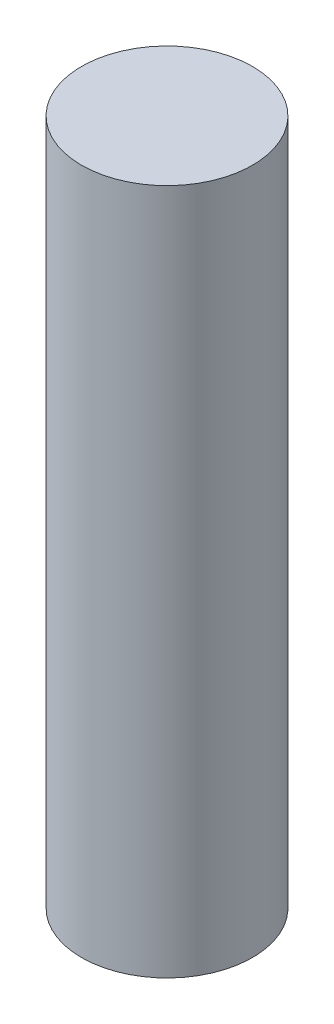
ISO-10303-21;
HEADER;
FILE_DESCRIPTION(('STEP AP214'),'2;1');
FILE_NAME('part.step','',(''),(''),'','','');
FILE_SCHEMA(('AUTOMOTIVE_DESIGN { 1 0 10303 214 1 1 1 1 }'));
ENDSEC;
DATA;
#1=APPLICATION_CONTEXT('core data for automotive mechanical design processes');
#2=APPLICATION_PROTOCOL_DEFINITION('international standard','automotive_design',2000,#1);
#3=PRODUCT_CONTEXT('',#1,'mechanical');
#4=PRODUCT('Part','Part','',(#3));
#5=PRODUCT_RELATED_PRODUCT_CATEGORY('part','',(#4));
#6=PRODUCT_DEFINITION_FORMATION('','',#4);
#7=PRODUCT_DEFINITION_CONTEXT('part definition',#1,'design');
#8=PRODUCT_DEFINITION('design','',#6,#7);
#9=PRODUCT_DEFINITION_SHAPE('','',#8);
#10=(LENGTH_UNIT() NAMED_UNIT(*) SI_UNIT(.MILLI.,.METRE.));
#11=(NAMED_UNIT(*) PLANE_ANGLE_UNIT() SI_UNIT($,.RADIAN.));
#12=(NAMED_UNIT(*) SI_UNIT($,.STERADIAN.) SOLID_ANGLE_UNIT());
#13=UNCERTAINTY_MEASURE_WITH_UNIT(LENGTH_MEASURE(1.E-05),#10,'distance_accuracy_value','');
#14=(GEOMETRIC_REPRESENTATION_CONTEXT(3) GLOBAL_UNCERTAINTY_ASSIGNED_CONTEXT((#13)) GLOBAL_UNIT_ASSIGNED_CONTEXT((#10,
#11,#12)) REPRESENTATION_CONTEXT('',''));
#15=CARTESIAN_POINT('',(0.,0.,0.));
#16=DIRECTION('',(0.,0.,1.));
#17=DIRECTION('',(1.,0.,0.));
#18=AXIS2_PLACEMENT_3D('',#15,#16,#17);
#19=CARTESIAN_POINT('',(0.,7.5,0.));
#20=DIRECTION('',(0.,-1.,0.));
#21=DIRECTION('',(0.,0.,-1.));
#22=AXIS2_PLACEMENT_3D('',#19,#20,#21);
#23=CYLINDRICAL_SURFACE('',#22,0.935);
#24=CARTESIAN_POINT('',(0.,7.5,0.));
#25=DIRECTION('',(0.,1.,0.));
#26=DIRECTION('',(0.,0.,1.));
#27=AXIS2_PLACEMENT_3D('',#24,#25,#26);
#28=CIRCLE('',#27,0.935);
#29=CARTESIAN_POINT('',(0.,7.5,0.935));
#30=VERTEX_POINT('',#29);
#31=EDGE_CURVE('E10',#30,#30,#28,.T.);
#32=ORIENTED_EDGE('',*,*,#31,.F.);
#33=EDGE_LOOP('',(#32));
#34=FACE_BOUND('',#33,.T.);
#35=CARTESIAN_POINT('',(0.,0.,0.));
#36=DIRECTION('',(0.,1.,0.));
#37=DIRECTION('',(0.,0.,1.));
#38=AXIS2_PLACEMENT_3D('',#35,#36,#37);
#39=CIRCLE('',#38,0.935);
#40=CARTESIAN_POINT('',(0.,0.,0.935));
#41=VERTEX_POINT('',#40);
#42=EDGE_CURVE('E34',#41,#41,#39,.T.);
#43=ORIENTED_EDGE('',*,*,#42,.T.);
#44=EDGE_LOOP('',(#43));
#45=FACE_BOUND('',#44,.T.);
#46=ADVANCED_FACE('F31',(#34,#45),#23,.T.);
#47=CARTESIAN_POINT('',(0.,7.5,0.));
#48=DIRECTION('',(0.,1.,0.));
#49=DIRECTION('',(0.,0.,1.));
#50=AXIS2_PLACEMENT_3D('',#47,#48,#49);
#51=PLANE('',#50);
#52=ORIENTED_EDGE('',*,*,#31,.T.);
#53=EDGE_LOOP('',(#52));
#54=FACE_BOUND('',#53,.T.);
#55=ADVANCED_FACE('F46',(#54),#51,.T.);
#56=CARTESIAN_POINT('',(0.,0.,0.));
#57=DIRECTION('',(0.,1.,0.));
#58=DIRECTION('',(0.,0.,1.));
#59=AXIS2_PLACEMENT_3D('',#56,#57,#58);
#60=PLANE('',#59);
#61=ORIENTED_EDGE('',*,*,#42,.F.);
#62=EDGE_LOOP('',(#61));
#63=FACE_BOUND('',#62,.T.);
#64=ADVANCED_FACE('F44',(#63),#60,.F.);
#65=CLOSED_SHELL('',(#46,#55,#64));
#66=MANIFOLD_SOLID_BREP('B2',#65);
#67=ADVANCED_BREP_SHAPE_REPRESENTATION('',(#18,#66),#14);
#68=SHAPE_DEFINITION_REPRESENTATION(#9,#67);
ENDSEC;
END-ISO-10303-21;
